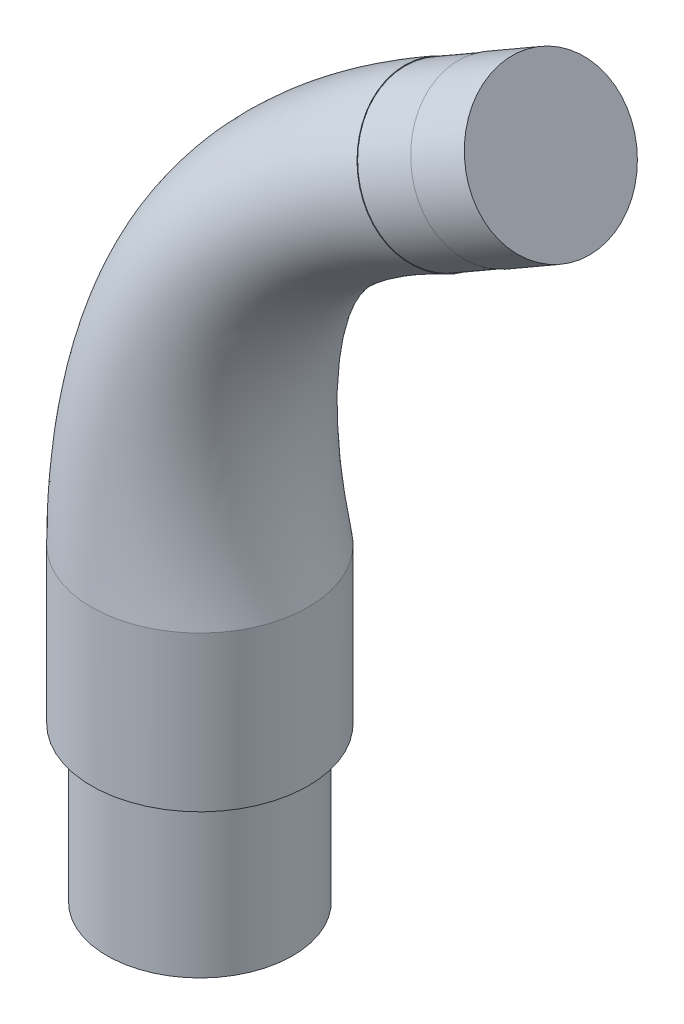
ISO-10303-21;
HEADER;
FILE_DESCRIPTION(('STEP AP214'),'2;1');
FILE_NAME('part.step','',(''),(''),'','','');
FILE_SCHEMA(('AUTOMOTIVE_DESIGN { 1 0 10303 214 1 1 1 1 }'));
ENDSEC;
DATA;
#1=APPLICATION_CONTEXT('core data for automotive mechanical design processes');
#2=APPLICATION_PROTOCOL_DEFINITION('international standard','automotive_design',2000,#1);
#3=PRODUCT_CONTEXT('',#1,'mechanical');
#4=PRODUCT('Part','Part','',(#3));
#5=PRODUCT_RELATED_PRODUCT_CATEGORY('part','',(#4));
#6=PRODUCT_DEFINITION_FORMATION('','',#4);
#7=PRODUCT_DEFINITION_CONTEXT('part definition',#1,'design');
#8=PRODUCT_DEFINITION('design','',#6,#7);
#9=PRODUCT_DEFINITION_SHAPE('','',#8);
#10=(LENGTH_UNIT() NAMED_UNIT(*) SI_UNIT(.MILLI.,.METRE.));
#11=(NAMED_UNIT(*) PLANE_ANGLE_UNIT() SI_UNIT($,.RADIAN.));
#12=(NAMED_UNIT(*) SI_UNIT($,.STERADIAN.) SOLID_ANGLE_UNIT());
#13=UNCERTAINTY_MEASURE_WITH_UNIT(LENGTH_MEASURE(1.E-05),#10,'distance_accuracy_value','');
#14=(GEOMETRIC_REPRESENTATION_CONTEXT(3) GLOBAL_UNCERTAINTY_ASSIGNED_CONTEXT((#13)) GLOBAL_UNIT_ASSIGNED_CONTEXT((#10,
#11,#12)) REPRESENTATION_CONTEXT('',''));
#15=CARTESIAN_POINT('',(0.,0.,0.));
#16=DIRECTION('',(0.,0.,1.));
#17=DIRECTION('',(1.,0.,0.));
#18=AXIS2_PLACEMENT_3D('',#15,#16,#17);
#19=CARTESIAN_POINT('',(41.804310128037,113.52547828024,0.));
#20=DIRECTION('',(0.86602540378444,0.499999999999998,0.));
#21=DIRECTION('',(-0.499999999999998,0.86602540378444,0.));
#22=AXIS2_PLACEMENT_3D('',#19,#20,#21);
#23=PLANE('',#22);
#24=CARTESIAN_POINT('',(48.0112066797611,102.77481809533,0.));
#25=DIRECTION('',(0.86602540378444,0.499999999999998,0.));
#26=DIRECTION('',(-0.499999999999998,0.86602540378444,0.));
#27=AXIS2_PLACEMENT_3D('',#24,#25,#26);
#28=CIRCLE('',#27,12.4137931034483);
#29=CARTESIAN_POINT('',(41.804310128037,113.52547828024,0.));
#30=VERTEX_POINT('',#29);
#31=EDGE_CURVE('E103',#30,#30,#28,.T.);
#32=ORIENTED_EDGE('',*,*,#31,.T.);
#33=EDGE_LOOP('',(#32));
#34=FACE_BOUND('',#33,.T.);
#35=CARTESIAN_POINT('',(48.0112066797611,102.77481809533,0.));
#36=DIRECTION('',(0.86602540378444,0.499999999999998,0.));
#37=DIRECTION('',(-0.499999999999998,0.86602540378444,0.));
#38=AXIS2_PLACEMENT_3D('',#35,#36,#37);
#39=CIRCLE('',#38,12.5);
#40=CARTESIAN_POINT('',(54.2612066797611,91.9495005480244,0.));
#41=VERTEX_POINT('',#40);
#42=EDGE_CURVE('E12',#41,#41,#39,.T.);
#43=ORIENTED_EDGE('',*,*,#42,.F.);
#44=EDGE_LOOP('',(#43));
#45=FACE_BOUND('',#44,.T.);
#46=ADVANCED_FACE('F99',(#34,#45),#23,.F.);
#47=CARTESIAN_POINT('',(31.8509526419119,110.765199152105,0.));
#48=DIRECTION('',(-0.86602540378444,-0.499999999999998,0.));
#49=DIRECTION('',(0.499999999999998,-0.86602540378444,0.));
#50=AXIS2_PLACEMENT_3D('',#47,#48,#49);
#51=PLANE('',#50);
#52=CARTESIAN_POINT('',(33.1009526383151,108.600135648872,0.));
#53=CARTESIAN_POINT('',(33.100952418386,108.600136029801,-0.163204373502805));
#54=CARTESIAN_POINT('',(33.1088536192003,108.58645074855,-0.979414534883471));
#55=CARTESIAN_POINT('',(33.203779294381,108.422034656194,-2.60754289027264));
#56=CARTESIAN_POINT('',(33.5370766000837,107.844746788691,-4.8138637771617));
#57=CARTESIAN_POINT('',(34.1204626428255,106.834292522236,-6.98476539806069));
#58=CARTESIAN_POINT('',(34.9024417983047,105.479864894486,-8.88991224848546));
#59=CARTESIAN_POINT('',(35.8553253926273,103.82942209542,-10.4565631730153));
#60=CARTESIAN_POINT('',(36.9408454601001,101.949246185922,-11.6257441393228));
#61=CARTESIAN_POINT('',(38.1207340350301,99.9056192268732,-12.3384811150808));
#62=CARTESIAN_POINT('',(39.347866813324,97.7801629072348,-12.5813770214524));
#63=CARTESIAN_POINT('',(40.5751194908891,95.6544989159676,-12.3410347796013));
#64=CARTESIAN_POINT('',(41.7554344195306,93.6101334906287,-11.6304408182749));
#65=CARTESIAN_POINT('',(42.8417539510539,91.7285728687754,-10.462581566221));
#66=CARTESIAN_POINT('',(43.7953782533374,90.0768471258879,-8.89805181907429));
#67=CARTESIAN_POINT('',(44.5776074942591,88.721986337446,-6.99744637246943));
#68=CARTESIAN_POINT('',(45.1629662417226,87.7081152461838,-4.81916844688674));
#69=CARTESIAN_POINT('',(45.5203995749578,87.0890225527022,-2.47239055882264));
#70=CARTESIAN_POINT('',(45.6413187915151,86.8795843260128,0.0142550172632548));
#71=CARTESIAN_POINT('',(45.5210673912695,87.0878658609207,2.45523514858085));
#72=CARTESIAN_POINT('',(45.0444433999077,87.9134028300639,5.60857937892127));
#73=CARTESIAN_POINT('',(43.8811226264064,89.9283335152706,9.06675195601013));
#74=CARTESIAN_POINT('',(42.1515091562266,92.9241119230753,11.3902401235519));
#75=CARTESIAN_POINT('',(40.5768087718745,95.651572995473,12.3410786173604));
#76=CARTESIAN_POINT('',(39.5539806690635,97.4231632369502,12.5408556171448));
#77=CARTESIAN_POINT('',(38.7360727749697,98.8398212654322,12.460121107463));
#78=CARTESIAN_POINT('',(37.9261289331388,100.242685150761,12.220875931028));
#79=CARTESIAN_POINT('',(36.9431210916423,101.945304676472,11.6280995970463));
#80=CARTESIAN_POINT('',(35.8569527800713,103.826603377684,10.4579766522858));
#81=CARTESIAN_POINT('',(34.9034860945303,105.478056120365,8.8917666288889));
#82=CARTESIAN_POINT('',(34.1219815628245,106.831661675625,6.99217379220179));
#83=CARTESIAN_POINT('',(33.5377766339165,107.843534294525,4.81093585538185));
#84=CARTESIAN_POINT('',(33.2044137285441,108.420935783991,2.62171050997335));
#85=CARTESIAN_POINT('',(33.108918573409,108.586338244559,0.980953407864087));
#86=CARTESIAN_POINT('',(33.1009528582441,108.600135267944,0.16320437350277));
#87=CARTESIAN_POINT('',(33.1009526383151,108.600135648872,0.));
#88=B_SPLINE_CURVE_WITH_KNOTS('',3,(#52,#53,#54,#55,#56,#57,#58,#59,#60,#61,#62,#63,#64,#65,#66,
#67,#68,#69,#70,#71,#72,#73,#74,#75,#76,#77,#78,#79,#80,#81,#82,#83,#84,#85,#86,#87),
.UNSPECIFIED.,.T.,.F.,(4,1,1,1,1,1,1,1,1,1,1,1,1,1,1,1,1,1,1,1,1,1,1,1,1,1,1,1,1,1,1,1,1,4),(0.,
0.00625000000000009,0.03125,0.0625,0.09375,0.125,0.15625,0.1875,0.21875,0.25,0.28125,0.3125,
0.34375,0.375,0.40625,0.4375,0.46875,0.5,0.53125,0.5625,0.625,0.6875,0.71875,0.75,0.765625,
0.78125,0.8125,0.84375,0.875,0.90625,0.9375,0.96875,0.99375,1.),.UNSPECIFIED.);
#89=CARTESIAN_POINT('',(33.1009526383151,108.600135648872,0.));
#90=VERTEX_POINT('',#89);
#91=EDGE_CURVE('E121',#90,#90,#88,.F.);
#92=ORIENTED_EDGE('',*,*,#91,.T.);
#93=EDGE_LOOP('',(#92));
#94=FACE_BOUND('',#93,.T.);
#95=CARTESIAN_POINT('',(39.3509526419167,97.7748180953299,0.));
#96=DIRECTION('',(0.86602540378444,0.499999999999998,0.));
#97=DIRECTION('',(-0.499999999999998,0.86602540378444,0.));
#98=AXIS2_PLACEMENT_3D('',#95,#96,#97);
#99=CIRCLE('',#98,12.4137931034483);
#100=CARTESIAN_POINT('',(33.1440560901926,108.52547828024,0.));
#101=VERTEX_POINT('',#100);
#102=EDGE_CURVE('E125',#101,#101,#99,.T.);
#103=ORIENTED_EDGE('',*,*,#102,.F.);
#104=EDGE_LOOP('',(#103));
#105=FACE_BOUND('',#104,.T.);
#106=ADVANCED_FACE('F178',(#94,#105),#51,.F.);
#107=CARTESIAN_POINT('',(56.6714607176055,107.77481809533,0.));
#108=DIRECTION('',(0.86602540378444,0.499999999999998,0.));
#109=DIRECTION('',(-0.499999999999998,0.86602540378444,0.));
#110=AXIS2_PLACEMENT_3D('',#107,#108,#109);
#111=CYLINDRICAL_SURFACE('',#110,12.4137931034483);
#112=ORIENTED_EDGE('',*,*,#31,.F.);
#113=EDGE_LOOP('',(#112));
#114=FACE_BOUND('',#113,.T.);
#115=ORIENTED_EDGE('',*,*,#102,.T.);
#116=EDGE_LOOP('',(#115));
#117=FACE_BOUND('',#116,.T.);
#118=ADVANCED_FACE('F188',(#114,#117),#111,.T.);
#119=CARTESIAN_POINT('',(0.,-25.,0.));
#120=DIRECTION('',(0.,-1.,0.));
#121=DIRECTION('',(0.,0.,-1.));
#122=AXIS2_PLACEMENT_3D('',#119,#120,#121);
#123=PLANE('',#122);
#124=CARTESIAN_POINT('',(0.,-25.,0.));
#125=DIRECTION('',(0.,-1.,0.));
#126=DIRECTION('',(0.,0.,-1.));
#127=AXIS2_PLACEMENT_3D('',#124,#125,#126);
#128=CIRCLE('',#127,15.);
#129=CARTESIAN_POINT('',(0.,-25.,-15.));
#130=VERTEX_POINT('',#129);
#131=EDGE_CURVE('E131',#130,#130,#128,.T.);
#132=ORIENTED_EDGE('',*,*,#131,.T.);
#133=EDGE_LOOP('',(#132));
#134=FACE_BOUND('',#133,.T.);
#135=ADVANCED_FACE('F167',(#134),#123,.T.);
#136=CARTESIAN_POINT('',(0.,-25.,0.));
#137=DIRECTION('',(0.,1.,0.));
#138=DIRECTION('',(0.,0.,1.));
#139=AXIS2_PLACEMENT_3D('',#136,#137,#138);
#140=CYLINDRICAL_SURFACE('',#139,15.);
#141=ORIENTED_EDGE('',*,*,#131,.F.);
#142=EDGE_LOOP('',(#141));
#143=FACE_BOUND('',#142,.T.);
#144=CARTESIAN_POINT('',(0.,0.,0.));
#145=DIRECTION('',(0.,-1.,0.));
#146=DIRECTION('',(0.,0.,-1.));
#147=AXIS2_PLACEMENT_3D('',#144,#145,#146);
#148=CIRCLE('',#147,15.);
#149=CARTESIAN_POINT('',(0.,0.,-15.));
#150=VERTEX_POINT('',#149);
#151=EDGE_CURVE('E138',#150,#150,#148,.T.);
#152=ORIENTED_EDGE('',*,*,#151,.T.);
#153=EDGE_LOOP('',(#152));
#154=FACE_BOUND('',#153,.T.);
#155=ADVANCED_FACE('F207',(#143,#154),#140,.T.);
#156=CARTESIAN_POINT('',(0.,0.,0.));
#157=DIRECTION('',(0.,-1.,0.));
#158=DIRECTION('',(0.,0.,-1.));
#159=AXIS2_PLACEMENT_3D('',#156,#157,#158);
#160=PLANE('',#159);
#161=CARTESIAN_POINT('',(0.,0.,0.));
#162=DIRECTION('',(0.,-1.,0.));
#163=DIRECTION('',(0.,0.,-1.));
#164=AXIS2_PLACEMENT_3D('',#161,#162,#163);
#165=CIRCLE('',#164,17.5);
#166=CARTESIAN_POINT('',(0.,0.,-17.5));
#167=VERTEX_POINT('',#166);
#168=EDGE_CURVE('E144',#167,#167,#165,.F.);
#169=ORIENTED_EDGE('',*,*,#168,.F.);
#170=EDGE_LOOP('',(#169));
#171=FACE_BOUND('',#170,.T.);
#172=ORIENTED_EDGE('',*,*,#151,.F.);
#173=EDGE_LOOP('',(#172));
#174=FACE_BOUND('',#173,.T.);
#175=ADVANCED_FACE('F101',(#171,#174),#160,.T.);
#176=CARTESIAN_POINT('',(0.,0.,0.));
#177=DIRECTION('',(0.,-1.,0.));
#178=DIRECTION('',(0.,0.,-1.));
#179=AXIS2_PLACEMENT_3D('',#176,#177,#178);
#180=CYLINDRICAL_SURFACE('',#179,17.5);
#181=ORIENTED_EDGE('',*,*,#168,.T.);
#182=EDGE_LOOP('',(#181));
#183=FACE_BOUND('',#182,.T.);
#184=CARTESIAN_POINT('',(-17.4999999616529,25.,1.36731446477578E-13));
#185=CARTESIAN_POINT('',(-17.4999989373348,25.,0.230784015119541));
#186=CARTESIAN_POINT('',(-17.4780380031465,25.,1.38128253565408));
#187=CARTESIAN_POINT('',(-17.2132741996687,25.,3.64896469356728));
#188=CARTESIAN_POINT('',(-16.2731424023503,25.,6.74884493717982));
#189=CARTESIAN_POINT('',(-14.6477195669793,25.,9.7767837874374));
#190=CARTESIAN_POINT('',(-12.4468154727515,25.,12.4550946057478));
#191=CARTESIAN_POINT('',(-9.78972141956984,25.,14.6387812679942));
#192=CARTESIAN_POINT('',(-6.73796788937528,25.,16.2781508168458));
#193=CARTESIAN_POINT('',(-3.99730685858886,25.,17.1082699042775));
#194=CARTESIAN_POINT('',(-1.7108853618894,25.,17.4470287956589));
#195=CARTESIAN_POINT('',(0.597356681315679,25.0000000000001,17.5543764078995));
#196=CARTESIAN_POINT('',(3.44826358833922,24.9999999999999,17.2755320539602));
#197=CARTESIAN_POINT('',(7.86001517650971,25.0000000000001,15.9360346047849));
#198=CARTESIAN_POINT('',(12.7023985610397,24.9999999999999,12.6783081126429));
#199=CARTESIAN_POINT('',(15.9487412291351,25.0000000000001,7.83294582644095));
#200=CARTESIAN_POINT('',(17.2811061360373,25.,3.42131630472168));
#201=CARTESIAN_POINT('',(17.6107506596624,25.,-0.0101083648408723));
#202=CARTESIAN_POINT('',(17.2762929242651,25.,-3.45213514567488));
#203=CARTESIAN_POINT('',(16.2710204529551,25.,-6.7497993083937));
#204=CARTESIAN_POINT('',(14.6383586189693,25.,-9.79443416588529));
#205=CARTESIAN_POINT('',(12.442482238491,25.,-12.4560836862655));
#206=CARTESIAN_POINT('',(9.77830103143156,25.,-14.6491824674669));
#207=CARTESIAN_POINT('',(6.7326678165439,25.,-16.2779926943879));
#208=CARTESIAN_POINT('',(3.43371623011733,25.,-17.280148219038));
#209=CARTESIAN_POINT('',(-0.00895426082335882,25.,-17.6104690674224));
#210=CARTESIAN_POINT('',(-3.43982640018719,25.,-17.2779259969118));
#211=CARTESIAN_POINT('',(-6.7467440765761,25.,-16.2740838440678));
#212=CARTESIAN_POINT('',(-9.78778253456852,25.,-14.6401712336774));
#213=CARTESIAN_POINT('',(-12.4522094976142,25.0000000000001,-12.4497897374944));
#214=CARTESIAN_POINT('',(-14.6463250734073,24.9999999999999,-9.77854950874001));
#215=CARTESIAN_POINT('',(-16.2783747568473,25.,-6.73760457607559));
#216=CARTESIAN_POINT('',(-17.2077530768399,25.,-3.66594945942846));
#217=CARTESIAN_POINT('',(-17.4774182991742,25.,-1.38318262028971));
#218=CARTESIAN_POINT('',(-17.500000985971,25.,-0.230784015119271));
#219=CARTESIAN_POINT('',(-17.4999999616529,25.,1.36731446477578E-13));
#220=B_SPLINE_CURVE_WITH_KNOTS('',3,(#184,#185,#186,#187,#188,#189,#190,#191,#192,#193,#194,
#195,#196,#197,#198,#199,#200,#201,#202,#203,#204,#205,#206,#207,#208,#209,#210,#211,#212,#213,
#214,#215,#216,#217,#218,#219),.UNSPECIFIED.,.T.,.F.,(4,1,1,1,1,1,1,1,1,1,1,1,1,1,1,1,1,1,1,1,1,
1,1,1,1,1,1,1,1,1,1,1,1,4),(0.,0.00624999999999998,0.03125,0.0625,0.09375,0.125,0.15625,0.1875,
0.21875,0.234375,0.25,0.28125,0.3125,0.375,0.4375,0.46875,0.5,0.53125,0.5625,0.59375,0.625,
0.65625,0.6875,0.71875,0.75,0.78125,0.8125,0.84375,0.875,0.90625,0.9375,0.96875,0.99375,1.),.UNSPECIFIED.);
#221=CARTESIAN_POINT('',(-17.4999999616529,25.,1.36731446477578E-13));
#222=VERTEX_POINT('',#221);
#223=EDGE_CURVE('E115',#222,#222,#220,.F.);
#224=ORIENTED_EDGE('',*,*,#223,.T.);
#225=EDGE_LOOP('',(#224));
#226=FACE_BOUND('',#225,.T.);
#227=ADVANCED_FACE('F165',(#183,#226),#180,.T.);
#228=CARTESIAN_POINT('',(33.1009526383156,108.600135648873,0.));
#229=CARTESIAN_POINT('',(21.9110935338608,102.139667482722,0.));
#230=CARTESIAN_POINT('',(7.86025460776531,91.6000519206385,0.));
#231=CARTESIAN_POINT('',(-4.83389269552725,74.3100298946951,0.));
#232=CARTESIAN_POINT('',(-12.5903042424737,59.0846350069929,0.));
#233=CARTESIAN_POINT('',(-16.7556684917356,42.1673576924474,0.));
#234=CARTESIAN_POINT('',(-17.4999999616528,29.278799139469,0.));
#235=CARTESIAN_POINT('',(-17.4999999616529,25.,1.36731446477578E-13));
#236=CARTESIAN_POINT('',(33.1009524183865,108.600136029801,-0.163204373502805));
#237=CARTESIAN_POINT('',(21.9110932133831,102.139667816034,-0.171651828704866));
#238=CARTESIAN_POINT('',(7.86025415322278,91.6000521904629,-0.182915102307636));
#239=CARTESIAN_POINT('',(-4.83389331765083,74.3100300851593,-0.196994194311098));
#240=CARTESIAN_POINT('',(-12.5903049986621,59.084635133969,-0.208257467913868));
#241=CARTESIAN_POINT('',(-16.7556693819888,42.1673577559355,-0.219520741516638));
#242=CARTESIAN_POINT('',(-17.5000009524547,29.278799155341,-0.227968196718716));
#243=CARTESIAN_POINT('',(-17.500000985971,25.,-0.230784015119271));
#244=CARTESIAN_POINT('',(33.1088536192008,108.58645074855,-0.979414534883469));
#245=CARTESIAN_POINT('',(21.9208295999452,102.12769319494,-1.02988554555925));
#246=CARTESIAN_POINT('',(7.87243745411528,91.5903584495766,-1.09718022646032));
#247=CARTESIAN_POINT('',(-4.81865137384532,74.3031874445338,-1.18129857758665));
#248=CARTESIAN_POINT('',(-12.5726161405262,59.080073373552,-1.24859325848772));
#249=CARTESIAN_POINT('',(-16.7355336095225,42.165076875727,-1.31588793938878));
#250=CARTESIAN_POINT('',(-17.4780299942406,29.2782289352889,-1.36635895006458));
#251=CARTESIAN_POINT('',(-17.4774182991742,25.,-1.38318262028971));
#252=CARTESIAN_POINT('',(33.2037792943815,108.422034656194,-2.60754289027264));
#253=CARTESIAN_POINT('',(22.0375977185201,101.983829114128,-2.73984371141712));
#254=CARTESIAN_POINT('',(8.01832883054912,91.4738970508246,-2.91624480627645));
#255=CARTESIAN_POINT('',(-4.6363559250878,74.2209793983558,-3.13674617485061));
#256=CARTESIAN_POINT('',(-12.3611974339098,59.0252680094334,-3.31314726970994));
#257=CARTESIAN_POINT('',(-16.4949916450471,42.1376741936677,-3.48954836456927));
#258=CARTESIAN_POINT('',(-17.215645586371,29.2713782647741,-3.62184918571376));
#259=CARTESIAN_POINT('',(-17.2077530768399,25.,-3.66594945942846));
#260=CARTESIAN_POINT('',(33.5370766000842,107.844746788692,-4.81386377716168));
#261=CARTESIAN_POINT('',(22.4454051510091,101.478702230063,-5.05433137702593));
#262=CARTESIAN_POINT('',(8.52548309875305,91.0649848113435,-5.3749548435116));
#263=CARTESIAN_POINT('',(-4.00501811224016,73.9323354646045,-5.7757341766187));
#264=CARTESIAN_POINT('',(-11.6305127853471,58.8328387202658,-6.09635764310438));
#265=CARTESIAN_POINT('',(-15.6649601607695,42.0414595490839,-6.41698110959005));
#266=CARTESIAN_POINT('',(-16.3111039753072,29.2473246036282,-6.65744870945431));
#267=CARTESIAN_POINT('',(-16.2783747568473,25.,-6.73760457607559));
#268=CARTESIAN_POINT('',(34.1204626428259,106.834292522236,-6.98476539806068));
#269=CARTESIAN_POINT('',(23.1598741488381,100.594554746915,-7.3339884118956));
#270=CARTESIAN_POINT('',(9.4147293700318,90.3492463726043,-7.79961909700885));
#271=CARTESIAN_POINT('',(-2.89730024914925,73.4271083313768,-8.38165745340041));
#272=CARTESIAN_POINT('',(-10.3480176488065,58.4960206314473,-8.84728813851365));
#273=CARTESIAN_POINT('',(-14.2076877507792,41.8730505046746,-9.3129188236269));
#274=CARTESIAN_POINT('',(-14.7227486102295,29.2052223425257,-9.66214183746184));
#275=CARTESIAN_POINT('',(-14.6463250734073,24.9999999999999,-9.77854950874001));
#276=CARTESIAN_POINT('',(34.9024417983052,105.479864894486,-8.88991224848544));
#277=CARTESIAN_POINT('',(24.1183703568565,99.4094305726337,-9.33489693461157));
#278=CARTESIAN_POINT('',(10.6085816481026,89.3898601362814,-9.92820984944642));
#279=CARTESIAN_POINT('',(-1.4092528835131,72.7498945175019,-10.66985099299));
#280=CARTESIAN_POINT('',(-8.62461421311805,58.0445447555307,-11.2631639078248));
#281=CARTESIAN_POINT('',(-12.2489282450384,41.6473125667164,-11.8564768226597));
#282=CARTESIAN_POINT('',(-12.5874720519495,29.1487878580363,-12.3014615087858));
#283=CARTESIAN_POINT('',(-12.4522094976142,25.0000000000001,-12.4497897374944));
#284=CARTESIAN_POINT('',(35.8553253926278,103.829422095421,-10.4565631730153));
#285=CARTESIAN_POINT('',(25.2851968722695,97.9652931234515,-10.979514180598));
#286=CARTESIAN_POINT('',(12.0606653916361,88.2207964869434,-11.6767821907084));
#287=CARTESIAN_POINT('',(0.399402395171042,71.9246731179691,-12.5483672033464));
#288=CARTESIAN_POINT('',(-6.53070170631339,57.4943971558422,-13.2456352134568));
#289=CARTESIAN_POINT('',(-9.86975851011323,41.372238766872,-13.9429032235671));
#290=CARTESIAN_POINT('',(-9.99435939593397,29.0800194080751,-14.4658542311499));
#291=CARTESIAN_POINT('',(-9.78778253456852,25.,-14.6401712336774));
#292=CARTESIAN_POINT('',(36.9408454601006,101.949246185922,-11.6257441393228));
#293=CARTESIAN_POINT('',(26.6151567385573,96.3201392026403,-12.206786602416));
#294=CARTESIAN_POINT('',(13.7165449896771,86.8890052177153,-12.9815098865401));
#295=CARTESIAN_POINT('',(2.46268165790366,70.9845851632199,-13.9499139916954));
#296=CARTESIAN_POINT('',(-4.14150271182751,56.8676718526761,-14.7246372758196));
#297=CARTESIAN_POINT('',(-7.15463978387408,41.058876115289,-15.4993605599438));
#298=CARTESIAN_POINT('',(-7.03480087087987,29.0016787451794,-16.0804030230369));
#299=CARTESIAN_POINT('',(-6.7467440765761,25.,-16.2740838440678));
#300=CARTESIAN_POINT('',(38.1207340350305,99.9056192268735,-12.3384811150807));
#301=CARTESIAN_POINT('',(28.0609239511696,94.5319656134726,-12.9559117253096));
#302=CARTESIAN_POINT('',(15.5168170525325,85.4414361217224,-13.7791525389482));
#303=CARTESIAN_POINT('',(4.70608478356306,69.9627716836954,-14.8082035559963));
#304=CARTESIAN_POINT('',(-1.54359473592494,56.1864628663264,-15.6314443696348));
#305=CARTESIAN_POINT('',(-4.20222695772834,40.7182716221142,-16.4546851832734));
#306=CARTESIAN_POINT('',(-3.81650940705175,28.9165276218857,-17.0721157935023));
#307=CARTESIAN_POINT('',(-3.43982640018719,25.,-17.2779259969118));
#308=CARTESIAN_POINT('',(39.3478668133244,97.780162907235,-12.5813770214524));
#309=CARTESIAN_POINT('',(29.5635241495973,92.672191333789,-13.2100135271987));
#310=CARTESIAN_POINT('',(17.3867071444719,83.9359045619785,-14.0481955348603));
#311=CARTESIAN_POINT('',(7.03508724239195,68.9000435238762,-15.0959230444374));
#312=CARTESIAN_POINT('',(1.1526976164156,55.477977426447,-15.9341050520991));
#313=CARTESIAN_POINT('',(-1.13864471187615,40.3640289021745,-16.7722870597608));
#314=CARTESIAN_POINT('',(-0.477459741065832,28.8279669419008,-17.4009235655071));
#315=CARTESIAN_POINT('',(-0.00895426082335882,25.,-17.6104690674224));
#316=CARTESIAN_POINT('',(40.5751194908895,95.6544989159678,-12.3410347796013));
#317=CARTESIAN_POINT('',(31.0677040538343,90.8122353414301,-12.9584239595309));
#318=CARTESIAN_POINT('',(19.2601233509382,82.4302259014975,-13.7816095327704));
#319=CARTESIAN_POINT('',(9.37004882664482,67.8372115282426,-14.8105914993197));
#320=CARTESIAN_POINT('',(3.85689550289774,54.7694227626912,-15.6337770725592));
#321=CARTESIAN_POINT('',(1.93478947683526,40.0097515702966,-16.4569626457987));
#322=CARTESIAN_POINT('',(2.87290167431754,28.7393976089313,-17.0743518257283));
#323=CARTESIAN_POINT('',(3.43371623011733,25.,-17.280148219038));
#324=CARTESIAN_POINT('',(41.755434419531,93.6101334906289,-11.6304408182749));
#325=CARTESIAN_POINT('',(32.5128485646989,89.0234155942587,-12.2113848027891));
#326=CARTESIAN_POINT('',(21.0583739714336,80.9821337252158,-12.9859767821412));
#327=CARTESIAN_POINT('',(11.6096820841789,66.8150288155732,-13.9542167563315));
#328=CARTESIAN_POINT('',(6.44963487006263,54.0879676209116,-14.7288087356837));
#329=CARTESIAN_POINT('',(4.88063495363099,39.6690239994068,-15.5034007150359));
#330=CARTESIAN_POINT('',(6.0835767333364,28.6542157162089,-16.08434469955));
#331=CARTESIAN_POINT('',(6.7326678165439,25.,-16.2779926943879));
#332=CARTESIAN_POINT('',(42.8417539510543,91.7285728687756,-10.462581566221));
#333=CARTESIAN_POINT('',(33.8440823066428,87.377050050137,-10.9859066788768));
#334=CARTESIAN_POINT('',(22.7161599939382,79.6493616180697,-11.6836734957511));
#335=CARTESIAN_POINT('',(13.6756584573843,65.8742485046465,-12.555882016844));
#336=CARTESIAN_POINT('',(8.84216352382884,53.4607807469605,-13.2536488337184));
#337=CARTESIAN_POINT('',(7.59971588795792,39.3554305624312,-13.9514156505927));
#338=CARTESIAN_POINT('',(9.04757187808388,28.575817356965,-14.4747407632485));
#339=CARTESIAN_POINT('',(9.77830103143156,25.,-14.6491824674669));
#340=CARTESIAN_POINT('',(43.7953782533377,90.076847125888,-8.89805181907427));
#341=CARTESIAN_POINT('',(35.0115262220232,85.9317900251103,-9.34280580247317));
#342=CARTESIAN_POINT('',(24.1686967267813,78.4793892168577,-9.93581111367173));
#343=CARTESIAN_POINT('',(15.4845612120558,65.0483856332027,-10.6770677526699));
#344=CARTESIAN_POINT('',(10.9361590959629,52.9102054993313,-11.2700730638685));
#345=CARTESIAN_POINT('',(9.97880427755466,39.0801429386166,-11.863078375067));
#346=CARTESIAN_POINT('',(11.6404798807776,28.5069954510113,-12.3078323584659));
#347=CARTESIAN_POINT('',(12.442482238491,25.,-12.4560836862655));
#348=CARTESIAN_POINT('',(44.5776074942595,88.7219863374463,-6.99744637246942));
#349=CARTESIAN_POINT('',(35.9704613553895,84.7462868352238,-7.34706984664641));
#350=CARTESIAN_POINT('',(25.3632397167404,77.5196961583781,-7.81323447888241));
#351=CARTESIAN_POINT('',(16.9736140227558,64.3709552389818,-8.39594026917742));
#352=CARTESIAN_POINT('',(12.6608197632557,52.4585852365174,-8.86210490141342));
#353=CARTESIAN_POINT('',(11.9390728014403,38.8543328072097,-9.32826953364943));
#354=CARTESIAN_POINT('',(13.7774542971078,28.4505429181596,-9.67789300782643));
#355=CARTESIAN_POINT('',(14.6383586189693,25.,-9.79443416588529));
#356=CARTESIAN_POINT('',(45.1629662417229,87.708115246184,-4.81916844688673));
#357=CARTESIAN_POINT('',(36.6867329886682,83.8591496303693,-5.0604973045751));
#358=CARTESIAN_POINT('',(26.2540618644395,76.801537468734,-5.38226911482629));
#359=CARTESIAN_POINT('',(18.0826243134805,63.8640196933507,-5.78448387764027));
#360=CARTESIAN_POINT('',(13.9443805684008,52.1206282060966,-6.10625568789146));
#361=CARTESIAN_POINT('',(13.3971841210057,38.6853542919993,-6.42802749814265));
#362=CARTESIAN_POINT('',(15.3664785024885,28.408298289357,-6.66935635583104));
#363=CARTESIAN_POINT('',(16.2710204529551,25.,-6.7497993083937));
#364=CARTESIAN_POINT('',(45.5203995749582,87.0890225527024,-2.47239055882263));
#365=CARTESIAN_POINT('',(37.1251462141628,83.3174435235729,-2.59485863217917));
#366=CARTESIAN_POINT('',(26.8004482796132,76.3630134775179,-2.75814939665457));
#367=CARTESIAN_POINT('',(18.7639772157531,63.5544733466099,-2.96226285224882));
#368=CARTESIAN_POINT('',(14.7337066603525,51.9142639749361,-3.12555361672422));
#369=CARTESIAN_POINT('',(14.2944834026365,38.582172176419,-3.28884438119962));
#370=CARTESIAN_POINT('',(16.3447576763787,28.3825027604619,-3.41131245455617));
#371=CARTESIAN_POINT('',(17.2762929242651,25.,-3.45213514567488));
#372=CARTESIAN_POINT('',(45.6413187915155,86.879584326013,0.014255017263255));
#373=CARTESIAN_POINT('',(37.2727577455751,83.1341850752197,0.0112095945002362));
#374=CARTESIAN_POINT('',(26.9836495641655,76.2146614002795,0.00714903081618946));
#375=CARTESIAN_POINT('',(18.9916656917303,63.4497542332652,0.00207332621113106));
#376=CARTESIAN_POINT('',(14.9969848894698,51.8444512327063,-0.00198723747291563));
#377=CARTESIAN_POINT('',(14.5933513848938,38.5472658053041,-0.00604780115696234));
#378=CARTESIAN_POINT('',(16.6703179734909,28.3737761676832,-0.00909322391999739));
#379=CARTESIAN_POINT('',(17.6107506596624,25.,-0.0101083648408723));
#380=CARTESIAN_POINT('',(45.5210673912699,87.0878658609208,2.45523514858085));
#381=CARTESIAN_POINT('',(37.1263322049071,83.316431418264,2.57599529309845));
#382=CARTESIAN_POINT('',(26.8023251696009,76.3621941541726,2.7370088191219));
#383=CARTESIAN_POINT('',(18.766717729795,63.5538950007191,2.9382757266512));
#384=CARTESIAN_POINT('',(14.7371380736378,51.9138784110089,3.09928925267465));
#385=CARTESIAN_POINT('',(14.2986057151653,38.5819793944554,3.2603027786981));
#386=CARTESIAN_POINT('',(16.34939816334,28.382454564971,3.38106292321568));
#387=CARTESIAN_POINT('',(17.2811061360373,25.,3.42131630472168));
#388=CARTESIAN_POINT('',(45.0444433999081,87.9134028300641,5.60857937892126));
#389=CARTESIAN_POINT('',(36.5427405991027,84.0387762662644,5.88662518486122));
#390=CARTESIAN_POINT('',(26.0761100778732,76.9469495073157,6.25735292611447));
#391=CARTESIAN_POINT('',(17.862223280663,63.9666634852908,6.72076260268104));
#392=CARTESIAN_POINT('',(13.6900201385825,52.1890574007233,7.0914903439343));
#393=CARTESIAN_POINT('',(13.1088642941865,38.7195688893127,7.46221808518755));
#394=CARTESIAN_POINT('',(15.0526891279187,28.4168519386854,7.7402638911275));
#395=CARTESIAN_POINT('',(15.9487412291351,25.0000000000001,7.83294582644095));
#396=CARTESIAN_POINT('',(43.8811226264068,89.9283335152708,9.06675195601011));
#397=CARTESIAN_POINT('',(35.1190420887772,85.8018406158202,9.51819647558921));
#398=CARTESIAN_POINT('',(24.3052412517819,78.3741920760038,10.1201225016947));
#399=CARTESIAN_POINT('',(15.6573915598646,64.974128827894,10.8725300343265));
#400=CARTESIAN_POINT('',(11.1380181020184,52.8607009624588,11.4744560604319));
#401=CARTESIAN_POINT('',(10.2096919418568,39.0553906701803,12.0763820865373));
#402=CARTESIAN_POINT('',(11.8931390387647,28.5008073839022,12.5278266061164));
#403=CARTESIAN_POINT('',(12.7023985610397,24.9999999999999,12.6783081126429));
#404=CARTESIAN_POINT('',(42.151509156227,92.9241119230755,11.3902401235519));
#405=CARTESIAN_POINT('',(33.0003323793037,88.4231467226494,11.958464433706));
#406=CARTESIAN_POINT('',(21.6677365565834,80.4962017815322,12.7160968472448));
#407=CARTESIAN_POINT('',(12.3713931325098,66.4720180317966,13.6631373641683));
#408=CARTESIAN_POINT('',(7.33322468893851,53.8592937650605,14.4207697777072));
#409=CARTESIAN_POINT('',(5.88610354305184,39.5546870714813,15.178402191246));
#410=CARTESIAN_POINT('',(7.18045440066597,28.6256314842276,15.7466265014001));
#411=CARTESIAN_POINT('',(7.86001517650971,25.0000000000001,15.9360346047849));
#412=CARTESIAN_POINT('',(40.5768087718748,95.6515729954732,12.3410786173604));
#413=CARTESIAN_POINT('',(31.0710005944742,90.8096751609974,12.9578852969354));
#414=CARTESIAN_POINT('',(19.2655629044508,82.4281533744805,13.7802942030353));
#415=CARTESIAN_POINT('',(9.37816714624845,67.8357485679953,14.8083053356602));
#416=CARTESIAN_POINT('',(3.86715683537413,54.7684474558596,15.6307142417602));
#417=CARTESIAN_POINT('',(1.9471938221844,40.0092639168808,16.4531231478601));
#418=CARTESIAN_POINT('',(2.88691327932124,28.7392756955773,17.0699298274351));
#419=CARTESIAN_POINT('',(3.44826358833922,24.9999999999999,17.2755320539602));
#420=CARTESIAN_POINT('',(39.553980669064,97.4231632369504,12.5408556171448));
#421=CARTESIAN_POINT('',(29.8196626411367,92.35981662229,13.1675457159891));
#422=CARTESIAN_POINT('',(17.7095451504113,83.6830297955269,14.0031325144482));
#423=CARTESIAN_POINT('',(7.44129964133123,68.721543688734,15.0476160125221));
#424=CARTESIAN_POINT('',(1.6256095297548,55.3589775363521,15.8832028109812));
#425=CARTESIAN_POINT('',(-0.599033284137037,40.3045289571271,16.7187896094403));
#426=CARTESIAN_POINT('',(0.112176322473225,28.813091955639,17.3454797082846));
#427=CARTESIAN_POINT('',(0.597356681315679,25.0000000000001,17.5543764078995));
#428=CARTESIAN_POINT('',(38.7360727749702,98.8398212654325,12.460121107463));
#429=CARTESIAN_POINT('',(28.815462978404,93.5993923972117,13.0834845684875));
#430=CARTESIAN_POINT('',(16.4569564628267,84.686495899035,13.9146358498534));
#431=CARTESIAN_POINT('',(5.8782246726818,69.429872702975,14.9535749515609));
#432=CARTESIAN_POINT('',(-0.185854463746514,55.8311968791794,15.7847262329268));
#433=CARTESIAN_POINT('',(-2.65888630249023,40.5406386285407,16.6158775142928));
#434=CARTESIAN_POINT('',(-2.13396846451888,28.8721193734923,17.2392409753172));
#435=CARTESIAN_POINT('',(-1.7108853618894,25.,17.4470287956589));
#436=CARTESIAN_POINT('',(37.9261289331393,100.242685150761,12.220875931028));
#437=CARTESIAN_POINT('',(27.8209594297145,94.8268982968744,12.8318001776842));
#438=CARTESIAN_POINT('',(15.2163733049924,85.6801911511429,13.6463658398924));
#439=CARTESIAN_POINT('',(4.33004200341662,70.1313046456393,14.6645729176527));
#440=CARTESIAN_POINT('',(-1.98011674215646,56.298818174289,15.4791385798609));
#441=CARTESIAN_POINT('',(-4.69922819004493,40.7744492760955,16.2937042420692));
#442=CARTESIAN_POINT('',(-4.35887005893215,28.930572035381,16.9046284887253));
#443=CARTESIAN_POINT('',(-3.99730685858886,25.,17.1082699042775));
#444=CARTESIAN_POINT('',(36.9431210916427,101.945304676472,11.6280995970463));
#445=CARTESIAN_POINT('',(26.6182449395568,96.3166903818714,12.2093559995213));
#446=CARTESIAN_POINT('',(13.7207166166197,86.886213315188,12.9843645361545));
#447=CARTESIAN_POINT('',(2.46820756727513,70.9826144084947,13.953125206946));
#448=CARTESIAN_POINT('',(-4.13489337651292,56.8663580161926,14.7281337435792));
#449=CARTESIAN_POINT('',(-7.14694702261638,41.0582191970473,15.5031422802125));
#450=CARTESIAN_POINT('',(-7.02629554016483,29.001514515619,16.0843986826874));
#451=CARTESIAN_POINT('',(-6.73796788937528,25.,16.2781508168458));
#452=CARTESIAN_POINT('',(35.8569527800717,103.826603377684,10.4579766522858));
#453=CARTESIAN_POINT('',(25.2863784756578,97.9628267454321,10.9805772292493));
#454=CARTESIAN_POINT('',(12.0612526162835,88.2187998952134,11.677377998534));
#455=CARTESIAN_POINT('',(0.399246646392352,71.9232637591009,12.5483789601399));
#456=CARTESIAN_POINT('',(-6.53145183383296,57.4934575832634,13.2451797294246));
#457=CARTESIAN_POINT('',(-9.87110301637368,41.3717689805827,13.9419804987093));
#458=CARTESIAN_POINT('',(-9.99614968625007,29.0799019615028,14.4645810756728));
#459=CARTESIAN_POINT('',(-9.78972141956984,25.,14.6387812679942));
#460=CARTESIAN_POINT('',(34.9034860945307,105.478056120365,8.89176662888888));
#461=CARTESIAN_POINT('',(24.1199583691618,99.4078478952781,9.33718262599625));
#462=CARTESIAN_POINT('',(10.6108946151806,89.3885789212792,9.93107062213939));
#463=CARTESIAN_POINT('',(-1.40603372296895,72.7489901304415,10.6734306173183));
#464=CARTESIAN_POINT('',(-8.62067009780104,58.0439418308238,11.2673186134614));
#465=CARTESIAN_POINT('',(-12.2442591749485,41.6470111043629,11.8612066096046));
#466=CARTESIAN_POINT('',(-12.58225926578,29.1487124924479,12.3066226067119));
#467=CARTESIAN_POINT('',(-12.4468154727515,25.,12.4550946057478));
#468=CARTESIAN_POINT('',(34.1219815628249,106.831661675625,6.99217379220177));
#469=CARTESIAN_POINT('',(23.1610288921407,100.592252756131,7.34025004160623));
#470=CARTESIAN_POINT('',(9.41539854440592,90.347382856255,7.8043517074788));
#471=CARTESIAN_POINT('',(-2.89723803593578,73.4257929080714,8.38447878981953));
#472=CARTESIAN_POINT('',(-10.3484410045215,58.4951436825771,8.84858045569211));
#473=CARTESIAN_POINT('',(-14.2085966754227,41.8726120302395,9.31268212156468));
#474=CARTESIAN_POINT('',(-14.7240217115694,29.205112723917,9.66075837096912));
#475=CARTESIAN_POINT('',(-14.6477195669793,25.,9.7767837874374));
#476=CARTESIAN_POINT('',(33.537776633917,107.843534294526,4.81093585538184));
#477=CARTESIAN_POINT('',(22.4466717249248,101.477641297668,5.05317449060658));
#478=CARTESIAN_POINT('',(8.52750505944622,91.0641259613093,5.37615933757289));
#479=CARTESIAN_POINT('',(-4.00205191807526,73.9317292175216,5.77989039628077));
#480=CARTESIAN_POINT('',(-11.6267912044049,58.8324345555438,6.10287524324707));
#481=CARTESIAN_POINT('',(-15.6604831930498,42.0412574667229,6.42586009021338));
#482=CARTESIAN_POINT('',(-16.3060604675045,29.2472740830379,6.66809872543811));
#483=CARTESIAN_POINT('',(-16.2731424023503,25.,6.74884493717982));
#484=CARTESIAN_POINT('',(33.2044137285445,108.420935783991,2.62171050997335));
#485=CARTESIAN_POINT('',(22.0374627080592,101.98286760095,2.75011728292259));
#486=CARTESIAN_POINT('',(8.01716789392287,91.4731186830138,2.92132631352155));
#487=CARTESIAN_POINT('',(-4.63879926942069,74.2204299622541,3.13533760177025));
#488=CARTESIAN_POINT('',(-12.364666704408,59.0249017186989,3.30654663236921));
#489=CARTESIAN_POINT('',(-16.4994868417106,42.1374910483004,3.47775566296818));
#490=CARTESIAN_POINT('',(-17.2209102276585,29.2713324784323,3.6061624359174));
#491=CARTESIAN_POINT('',(-17.2132741996687,25.,3.64896469356728));
#492=CARTESIAN_POINT('',(33.1089185734095,108.586338244559,0.980953407864085));
#493=CARTESIAN_POINT('',(21.9208089718813,102.127594753948,1.03099454883783));
#494=CARTESIAN_POINT('',(7.87230271635453,91.5902787592499,1.09771607013614));
#495=CARTESIAN_POINT('',(-4.81892874872711,74.3031311925384,1.18111797175902));
#496=CARTESIAN_POINT('',(-12.5730076251048,59.0800358722217,1.24783949305733));
#497=CARTESIAN_POINT('',(-16.736039203798,42.1650581250619,1.31456101435564));
#498=CARTESIAN_POINT('',(-17.4786211707887,29.2782242476226,1.36460215532937));
#499=CARTESIAN_POINT('',(-17.4780380031465,25.,1.38128253565408));
#500=CARTESIAN_POINT('',(33.1009528582446,108.600135267944,0.16320437350277));
#501=CARTESIAN_POINT('',(21.9110938543385,102.13966714941,0.171651828704863));
#502=CARTESIAN_POINT('',(7.86025506230784,91.6000516508143,0.182915102307633));
#503=CARTESIAN_POINT('',(-4.83389207340367,74.3100297042309,0.196994194311095));
#504=CARTESIAN_POINT('',(-12.5903034862853,59.0846348800167,0.208257467913865));
#505=CARTESIAN_POINT('',(-16.7556676014823,42.1673576289594,0.219520741516634));
#506=CARTESIAN_POINT('',(-17.4999989708509,29.278799123597,0.227968196718711));
#507=CARTESIAN_POINT('',(-17.4999989373348,25.,0.230784015119541));
#508=CARTESIAN_POINT('',(33.1009526383156,108.600135648873,0.));
#509=CARTESIAN_POINT('',(21.9110935338608,102.139667482722,0.));
#510=CARTESIAN_POINT('',(7.86025460776531,91.6000519206385,0.));
#511=CARTESIAN_POINT('',(-4.83389269552725,74.3100298946951,0.));
#512=CARTESIAN_POINT('',(-12.5903042424737,59.0846350069929,0.));
#513=CARTESIAN_POINT('',(-16.7556684917356,42.1673576924474,0.));
#514=CARTESIAN_POINT('',(-17.4999999616528,29.278799139469,0.));
#515=CARTESIAN_POINT('',(-17.4999999616529,25.,1.36731446477578E-13));
#516=B_SPLINE_SURFACE_WITH_KNOTS('',3,3,((#228,#229,#230,#231,#232,#233,#234,#235),(#236,#237,
#238,#239,#240,#241,#242,#243),(#244,#245,#246,#247,#248,#249,#250,#251),(#252,#253,#254,#255,
#256,#257,#258,#259),(#260,#261,#262,#263,#264,#265,#266,#267),(#268,#269,#270,#271,#272,#273,
#274,#275),(#276,#277,#278,#279,#280,#281,#282,#283),(#284,#285,#286,#287,#288,#289,#290,#291),
(#292,#293,#294,#295,#296,#297,#298,#299),(#300,#301,#302,#303,#304,#305,#306,#307),(#308,#309,
#310,#311,#312,#313,#314,#315),(#316,#317,#318,#319,#320,#321,#322,#323),(#324,#325,#326,#327,
#328,#329,#330,#331),(#332,#333,#334,#335,#336,#337,#338,#339),(#340,#341,#342,#343,#344,#345,
#346,#347),(#348,#349,#350,#351,#352,#353,#354,#355),(#356,#357,#358,#359,#360,#361,#362,#363),
(#364,#365,#366,#367,#368,#369,#370,#371),(#372,#373,#374,#375,#376,#377,#378,#379),(#380,#381,
#382,#383,#384,#385,#386,#387),(#388,#389,#390,#391,#392,#393,#394,#395),(#396,#397,#398,#399,
#400,#401,#402,#403),(#404,#405,#406,#407,#408,#409,#410,#411),(#412,#413,#414,#415,#416,#417,
#418,#419),(#420,#421,#422,#423,#424,#425,#426,#427),(#428,#429,#430,#431,#432,#433,#434,#435),
(#436,#437,#438,#439,#440,#441,#442,#443),(#444,#445,#446,#447,#448,#449,#450,#451),(#452,#453,
#454,#455,#456,#457,#458,#459),(#460,#461,#462,#463,#464,#465,#466,#467),(#468,#469,#470,#471,
#472,#473,#474,#475),(#476,#477,#478,#479,#480,#481,#482,#483),(#484,#485,#486,#487,#488,#489,
#490,#491),(#492,#493,#494,#495,#496,#497,#498,#499),(#500,#501,#502,#503,#504,#505,#506,#507),
(#508,#509,#510,#511,#512,#513,#514,#515)),.UNSPECIFIED.,.T.,.F.,.F.,(4,1,1,1,1,1,1,1,1,1,1,1,1,
1,1,1,1,1,1,1,1,1,1,1,1,1,1,1,1,1,1,1,1,4),(4,1,1,1,1,4),(0.,0.00625000000000009,0.03125,0.0625,
0.09375,0.125,0.15625,0.1875,0.21875,0.25,0.28125,0.3125,0.34375,0.375,0.40625,0.4375,0.46875,
0.5,0.53125,0.5625,0.625,0.6875,0.71875,0.75,0.765625,0.78125,0.8125,0.84375,0.875,0.90625,
0.9375,0.96875,0.99375,1.),(0.,0.375,0.5,0.625,0.875,1.),.UNSPECIFIED.);
#517=ORIENTED_EDGE('',*,*,#91,.F.);
#518=EDGE_LOOP('',(#517));
#519=FACE_BOUND('',#518,.T.);
#520=ORIENTED_EDGE('',*,*,#223,.F.);
#521=EDGE_LOOP('',(#520));
#522=FACE_BOUND('',#521,.T.);
#523=ADVANCED_FACE('F152',(#519,#522),#516,.T.);
#524=CARTESIAN_POINT('',(56.6714607176055,107.77481809533,0.));
#525=DIRECTION('',(0.86602540378444,0.499999999999998,0.));
#526=DIRECTION('',(-0.499999999999998,0.86602540378444,0.));
#527=AXIS2_PLACEMENT_3D('',#524,#525,#526);
#528=PLANE('',#527);
#529=CARTESIAN_POINT('',(56.6714607176055,107.77481809533,0.));
#530=DIRECTION('',(0.86602540378444,0.499999999999998,0.));
#531=DIRECTION('',(-0.499999999999998,0.86602540378444,0.));
#532=AXIS2_PLACEMENT_3D('',#529,#530,#531);
#533=CIRCLE('',#532,12.5);
#534=CARTESIAN_POINT('',(62.9214607176055,96.9495005480244,0.));
#535=VERTEX_POINT('',#534);
#536=EDGE_CURVE('E108',#535,#535,#533,.T.);
#537=ORIENTED_EDGE('',*,*,#536,.T.);
#538=EDGE_LOOP('',(#537));
#539=FACE_BOUND('',#538,.T.);
#540=ADVANCED_FACE('F164',(#539),#528,.T.);
#541=CARTESIAN_POINT('',(56.6714607176055,107.77481809533,0.));
#542=DIRECTION('',(-0.86602540378444,-0.499999999999998,0.));
#543=DIRECTION('',(0.499999999999998,-0.86602540378444,0.));
#544=AXIS2_PLACEMENT_3D('',#541,#542,#543);
#545=CYLINDRICAL_SURFACE('',#544,12.5);
#546=CARTESIAN_POINT('',(62.9214607176055,96.9495005480244,0.));
#547=CARTESIAN_POINT('',(62.8312497380446,96.8974172146911,0.));
#548=CARTESIAN_POINT('',(62.7410387584837,96.8453338813578,0.));
#549=CARTESIAN_POINT('',(62.560616799362,96.7411672146911,0.));
#550=CARTESIAN_POINT('',(62.4704058198011,96.6890838813578,0.));
#551=CARTESIAN_POINT('',(62.2899838606794,96.5849172146911,0.));
#552=CARTESIAN_POINT('',(62.1997728811185,96.5328338813578,0.));
#553=CARTESIAN_POINT('',(62.0193509219967,96.4286672146911,0.));
#554=CARTESIAN_POINT('',(61.9291399424358,96.3765838813578,0.));
#555=CARTESIAN_POINT('',(61.7487179833141,96.2724172146911,0.));
#556=CARTESIAN_POINT('',(61.6585070037532,96.2203338813578,0.));
#557=CARTESIAN_POINT('',(61.4780850446314,96.1161672146911,0.));
#558=CARTESIAN_POINT('',(61.3878740650706,96.0640838813578,0.));
#559=CARTESIAN_POINT('',(61.2074521059488,95.9599172146911,0.));
#560=CARTESIAN_POINT('',(61.1172411263879,95.9078338813578,0.));
#561=CARTESIAN_POINT('',(60.9368191672662,95.8036672146911,0.));
#562=CARTESIAN_POINT('',(60.8466081877053,95.7515838813578,0.));
#563=CARTESIAN_POINT('',(60.6661862285835,95.6474172146911,0.));
#564=CARTESIAN_POINT('',(60.5759752490226,95.5953338813578,0.));
#565=CARTESIAN_POINT('',(60.3955532899009,95.4911672146911,0.));
#566=CARTESIAN_POINT('',(60.30534231034,95.4390838813578,0.));
#567=CARTESIAN_POINT('',(60.1249203512183,95.3349172146911,0.));
#568=CARTESIAN_POINT('',(60.0347093716574,95.2828338813578,0.));
#569=CARTESIAN_POINT('',(59.8542874125356,95.1786672146911,0.));
#570=CARTESIAN_POINT('',(59.7640764329747,95.1265838813578,0.));
#571=CARTESIAN_POINT('',(59.583654473853,95.0224172146911,0.));
#572=CARTESIAN_POINT('',(59.4934434942921,94.9703338813578,0.));
#573=CARTESIAN_POINT('',(59.3130215351703,94.8661672146911,0.));
#574=CARTESIAN_POINT('',(59.2228105556094,94.8140838813578,0.));
#575=CARTESIAN_POINT('',(59.0423885964877,94.7099172146911,0.));
#576=CARTESIAN_POINT('',(58.9521776169268,94.6578338813578,0.));
#577=CARTESIAN_POINT('',(58.7717556578051,94.5536672146911,0.));
#578=CARTESIAN_POINT('',(58.6815446782442,94.5015838813578,0.));
#579=CARTESIAN_POINT('',(58.5011227191224,94.3974172146911,0.));
#580=CARTESIAN_POINT('',(58.4109117395615,94.3453338813578,0.));
#581=CARTESIAN_POINT('',(58.2304897804398,94.2411672146911,0.));
#582=CARTESIAN_POINT('',(58.1402788008789,94.1890838813578,0.));
#583=CARTESIAN_POINT('',(57.9598568417571,94.0849172146911,0.));
#584=CARTESIAN_POINT('',(57.8696458621963,94.0328338813578,0.));
#585=CARTESIAN_POINT('',(57.6892239030745,93.9286672146911,0.));
#586=CARTESIAN_POINT('',(57.5990129235136,93.8765838813578,0.));
#587=CARTESIAN_POINT('',(57.4185909643919,93.7724172146911,0.));
#588=CARTESIAN_POINT('',(57.328379984831,93.7203338813578,0.));
#589=CARTESIAN_POINT('',(57.1479580257092,93.6161672146911,0.));
#590=CARTESIAN_POINT('',(57.0577470461483,93.5640838813578,0.));
#591=CARTESIAN_POINT('',(56.8773250870266,93.4599172146911,0.));
#592=CARTESIAN_POINT('',(56.7871141074657,93.4078338813578,0.));
#593=CARTESIAN_POINT('',(56.6066921483439,93.3036672146911,0.));
#594=CARTESIAN_POINT('',(56.5164811687831,93.2515838813578,0.));
#595=CARTESIAN_POINT('',(56.3360592096613,93.1474172146911,0.));
#596=CARTESIAN_POINT('',(56.2458482301004,93.0953338813577,0.));
#597=CARTESIAN_POINT('',(56.0654262709787,92.9911672146911,0.));
#598=CARTESIAN_POINT('',(55.9752152914178,92.9390838813578,0.));
#599=CARTESIAN_POINT('',(55.794793332296,92.8349172146911,0.));
#600=CARTESIAN_POINT('',(55.7045823527352,92.7828338813578,0.));
#601=CARTESIAN_POINT('',(55.5241603936134,92.6786672146911,0.));
#602=CARTESIAN_POINT('',(55.4339494140525,92.6265838813578,0.));
#603=CARTESIAN_POINT('',(55.2535274549307,92.5224172146911,0.));
#604=CARTESIAN_POINT('',(55.1633164753699,92.4703338813578,0.));
#605=CARTESIAN_POINT('',(54.9828945162481,92.3661672146911,0.));
#606=CARTESIAN_POINT('',(54.8926835366872,92.3140838813578,0.));
#607=CARTESIAN_POINT('',(54.7122615775655,92.2099172146911,0.));
#608=CARTESIAN_POINT('',(54.6220505980046,92.1578338813578,0.));
#609=CARTESIAN_POINT('',(54.4416286388828,92.0536672146911,0.));
#610=CARTESIAN_POINT('',(54.351417659322,92.0015838813578,0.));
#611=CARTESIAN_POINT('',(54.2612066797611,91.9495005480244,0.));
#612=B_SPLINE_CURVE_WITH_KNOTS('',3,(#546,#547,#548,#549,#550,#551,#552,#553,#554,#555,#556,
#557,#558,#559,#560,#561,#562,#563,#564,#565,#566,#567,#568,#569,#570,#571,#572,#573,#574,#575,
#576,#577,#578,#579,#580,#581,#582,#583,#584,#585,#586,#587,#588,#589,#590,#591,#592,#593,#594,
#595,#596,#597,#598,#599,#600,#601,#602,#603,#604,#605,#606,#607,#608,#609,#610,#611),
.UNSPECIFIED.,.F.,.F.,(4,2,2,2,2,2,2,2,2,2,2,2,2,2,2,2,2,2,2,2,2,2,2,2,2,2,2,2,2,2,2,2,4),(0.,
0.312499999999999,0.624999999999993,0.937499999999992,1.25,1.5625,1.875,2.1875,2.5,2.8125,3.125,
3.4375,3.75000000000001,4.06250000000001,4.37500000000001,4.68750000000001,5.00000000000001,
5.31250000000001,5.62500000000001,5.93750000000002,6.25000000000002,6.56250000000002,
6.87500000000002,7.18750000000002,7.50000000000003,7.81250000000003,8.12500000000002,
8.43750000000003,8.75000000000003,9.06250000000003,9.37500000000003,9.68750000000003,10.),.UNSPECIFIED.);
#613=EDGE_CURVE('BSEAM218',#535,#41,#612,.T.);
#614=ORIENTED_EDGE('',*,*,#536,.F.);
#615=ORIENTED_EDGE('',*,*,#42,.T.);
#616=ORIENTED_EDGE('',*,*,#613,.T.);
#617=ORIENTED_EDGE('',*,*,#613,.F.);
#618=EDGE_LOOP('',(#614,#616,#615,#617));
#619=FACE_BOUND('',#618,.T.);
#620=ADVANCED_FACE('F218',(#619),#545,.T.);
#621=CLOSED_SHELL('',(#46,#106,#118,#135,#155,#175,#227,#523,#540,#620));
#622=MANIFOLD_SOLID_BREP('B2',#621);
#623=ADVANCED_BREP_SHAPE_REPRESENTATION('',(#18,#622),#14);
#624=SHAPE_DEFINITION_REPRESENTATION(#9,#623);
ENDSEC;
END-ISO-10303-21;
